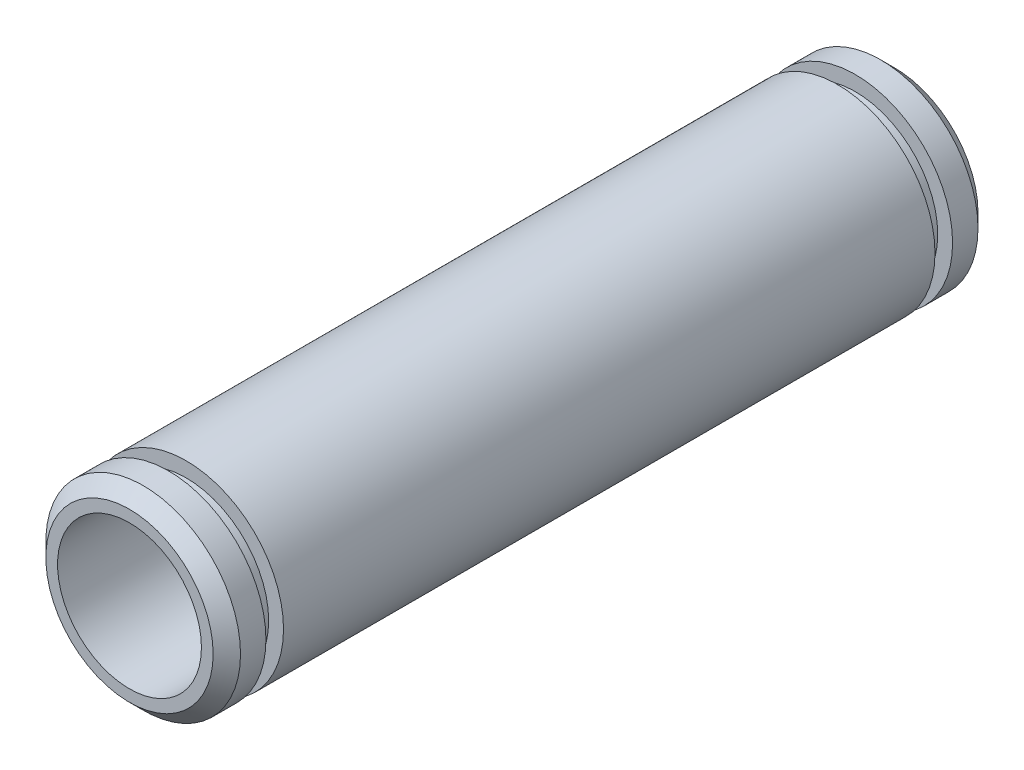
ISO-10303-21;
HEADER;
FILE_DESCRIPTION(('STEP AP214'),'2;1');
FILE_NAME('part.step','',(''),(''),'','','');
FILE_SCHEMA(('AUTOMOTIVE_DESIGN { 1 0 10303 214 1 1 1 1 }'));
ENDSEC;
DATA;
#1=APPLICATION_CONTEXT('core data for automotive mechanical design processes');
#2=APPLICATION_PROTOCOL_DEFINITION('international standard','automotive_design',2000,#1);
#3=PRODUCT_CONTEXT('',#1,'mechanical');
#4=PRODUCT('Part','Part','',(#3));
#5=PRODUCT_RELATED_PRODUCT_CATEGORY('part','',(#4));
#6=PRODUCT_DEFINITION_FORMATION('','',#4);
#7=PRODUCT_DEFINITION_CONTEXT('part definition',#1,'design');
#8=PRODUCT_DEFINITION('design','',#6,#7);
#9=PRODUCT_DEFINITION_SHAPE('','',#8);
#10=(LENGTH_UNIT() NAMED_UNIT(*) SI_UNIT(.MILLI.,.METRE.));
#11=(NAMED_UNIT(*) PLANE_ANGLE_UNIT() SI_UNIT($,.RADIAN.));
#12=(NAMED_UNIT(*) SI_UNIT($,.STERADIAN.) SOLID_ANGLE_UNIT());
#13=UNCERTAINTY_MEASURE_WITH_UNIT(LENGTH_MEASURE(1.E-05),#10,'distance_accuracy_value','');
#14=(GEOMETRIC_REPRESENTATION_CONTEXT(3) GLOBAL_UNCERTAINTY_ASSIGNED_CONTEXT((#13)) GLOBAL_UNIT_ASSIGNED_CONTEXT((#10,
#11,#12)) REPRESENTATION_CONTEXT('',''));
#15=CARTESIAN_POINT('',(0.,0.,0.));
#16=DIRECTION('',(0.,0.,1.));
#17=DIRECTION('',(1.,0.,0.));
#18=AXIS2_PLACEMENT_3D('',#15,#16,#17);
#19=CARTESIAN_POINT('',(0.,0.,24.84755));
#20=DIRECTION('',(0.,0.,-1.));
#21=DIRECTION('',(-1.,0.,0.));
#22=AXIS2_PLACEMENT_3D('',#19,#20,#21);
#23=CYLINDRICAL_SURFACE('',#22,6.3246);
#24=CARTESIAN_POINT('',(0.,0.,21.1645499999999));
#25=DIRECTION('',(0.,0.,1.));
#26=DIRECTION('',(1.,0.,0.));
#27=AXIS2_PLACEMENT_3D('',#24,#25,#26);
#28=CIRCLE('',#27,6.32460000000007);
#29=CARTESIAN_POINT('',(6.3246,0.,21.16455));
#30=VERTEX_POINT('',#29);
#31=EDGE_CURVE('E71',#30,#30,#28,.T.);
#32=ORIENTED_EDGE('',*,*,#31,.F.);
#33=EDGE_LOOP('',(#32));
#34=FACE_BOUND('',#33,.T.);
#35=CARTESIAN_POINT('',(0.,0.,-21.1645499999999));
#36=DIRECTION('',(0.,0.,1.));
#37=DIRECTION('',(1.,0.,0.));
#38=AXIS2_PLACEMENT_3D('',#35,#36,#37);
#39=CIRCLE('',#38,6.32460000000007);
#40=CARTESIAN_POINT('',(6.3246,0.,-21.16455));
#41=VERTEX_POINT('',#40);
#42=EDGE_CURVE('E57',#41,#41,#39,.T.);
#43=ORIENTED_EDGE('',*,*,#42,.T.);
#44=EDGE_LOOP('',(#43));
#45=FACE_BOUND('',#44,.T.);
#46=ADVANCED_FACE('F32',(#34,#45),#23,.T.);
#47=CARTESIAN_POINT('',(0.,0.,23.95855));
#48=DIRECTION('',(0.,0.,1.));
#49=DIRECTION('',(1.,0.,0.));
#50=AXIS2_PLACEMENT_3D('',#47,#48,#49);
#51=CIRCLE('',#50,6.3246);
#52=CARTESIAN_POINT('',(6.3246,0.,23.95855));
#53=VERTEX_POINT('',#52);
#54=EDGE_CURVE('E44',#53,#53,#51,.F.);
#55=ORIENTED_EDGE('',*,*,#54,.T.);
#56=EDGE_LOOP('',(#55));
#57=FACE_BOUND('',#56,.T.);
#58=CARTESIAN_POINT('',(0.,0.,22.3075500000001));
#59=DIRECTION('',(0.,0.,1.));
#60=DIRECTION('',(1.,0.,0.));
#61=AXIS2_PLACEMENT_3D('',#58,#59,#60);
#62=CIRCLE('',#61,6.32460000000007);
#63=CARTESIAN_POINT('',(6.3246,0.,22.3075500000001));
#64=VERTEX_POINT('',#63);
#65=EDGE_CURVE('E80',#64,#64,#62,.T.);
#66=ORIENTED_EDGE('',*,*,#65,.T.);
#67=EDGE_LOOP('',(#66));
#68=FACE_BOUND('',#67,.T.);
#69=ADVANCED_FACE('F84',(#57,#68),#23,.T.);
#70=CARTESIAN_POINT('',(0.,0.,24.84755));
#71=DIRECTION('',(0.,0.,1.));
#72=DIRECTION('',(1.,0.,0.));
#73=AXIS2_PLACEMENT_3D('',#70,#71,#72);
#74=PLANE('',#73);
#75=CARTESIAN_POINT('',(0.,0.,24.84755));
#76=DIRECTION('',(0.,0.,1.));
#77=DIRECTION('',(1.,0.,0.));
#78=AXIS2_PLACEMENT_3D('',#75,#76,#77);
#79=CIRCLE('',#78,5.4356);
#80=CARTESIAN_POINT('',(5.4356,0.,24.84755));
#81=VERTEX_POINT('',#80);
#82=EDGE_CURVE('E48',#81,#81,#79,.T.);
#83=ORIENTED_EDGE('',*,*,#82,.T.);
#84=EDGE_LOOP('',(#83));
#85=FACE_BOUND('',#84,.T.);
#86=CARTESIAN_POINT('',(0.,0.,24.84755));
#87=DIRECTION('',(0.,0.,1.));
#88=DIRECTION('',(1.,0.,0.));
#89=AXIS2_PLACEMENT_3D('',#86,#87,#88);
#90=CIRCLE('',#89,4.6736);
#91=CARTESIAN_POINT('',(4.6736,0.,24.84755));
#92=VERTEX_POINT('',#91);
#93=EDGE_CURVE('E53',#92,#92,#90,.T.);
#94=ORIENTED_EDGE('',*,*,#93,.F.);
#95=EDGE_LOOP('',(#94));
#96=FACE_BOUND('',#95,.T.);
#97=ADVANCED_FACE('F107',(#85,#96),#74,.T.);
#98=CARTESIAN_POINT('',(0.,0.,-24.84755));
#99=DIRECTION('',(0.,0.,1.));
#100=DIRECTION('',(1.,0.,0.));
#101=AXIS2_PLACEMENT_3D('',#98,#99,#100);
#102=PLANE('',#101);
#103=CARTESIAN_POINT('',(0.,0.,-24.84755));
#104=DIRECTION('',(0.,0.,1.));
#105=DIRECTION('',(1.,0.,0.));
#106=AXIS2_PLACEMENT_3D('',#103,#104,#105);
#107=CIRCLE('',#106,5.43559999999999);
#108=CARTESIAN_POINT('',(5.43559999999999,0.,-24.84755));
#109=VERTEX_POINT('',#108);
#110=EDGE_CURVE('E10',#109,#109,#107,.F.);
#111=ORIENTED_EDGE('',*,*,#110,.T.);
#112=EDGE_LOOP('',(#111));
#113=FACE_BOUND('',#112,.T.);
#114=CARTESIAN_POINT('',(0.,0.,-24.84755));
#115=DIRECTION('',(0.,0.,1.));
#116=DIRECTION('',(1.,0.,0.));
#117=AXIS2_PLACEMENT_3D('',#114,#115,#116);
#118=CIRCLE('',#117,4.6736);
#119=CARTESIAN_POINT('',(4.6736,0.,-24.84755));
#120=VERTEX_POINT('',#119);
#121=EDGE_CURVE('E54',#120,#120,#118,.T.);
#122=ORIENTED_EDGE('',*,*,#121,.T.);
#123=EDGE_LOOP('',(#122));
#124=FACE_BOUND('',#123,.T.);
#125=ADVANCED_FACE('F114',(#113,#124),#102,.F.);
#126=CARTESIAN_POINT('',(0.,0.,-23.95855));
#127=DIRECTION('',(0.,0.,1.));
#128=DIRECTION('',(1.,0.,0.));
#129=AXIS2_PLACEMENT_3D('',#126,#127,#128);
#130=CIRCLE('',#129,6.3246);
#131=CARTESIAN_POINT('',(6.3246,0.,-23.95855));
#132=VERTEX_POINT('',#131);
#133=EDGE_CURVE('E40',#132,#132,#130,.T.);
#134=ORIENTED_EDGE('',*,*,#133,.T.);
#135=EDGE_LOOP('',(#134));
#136=FACE_BOUND('',#135,.T.);
#137=CARTESIAN_POINT('',(0.,0.,-22.3075500000001));
#138=DIRECTION('',(0.,0.,1.));
#139=DIRECTION('',(1.,0.,0.));
#140=AXIS2_PLACEMENT_3D('',#137,#138,#139);
#141=CIRCLE('',#140,6.32460000000007);
#142=CARTESIAN_POINT('',(6.3246,0.,-22.3075500000001));
#143=VERTEX_POINT('',#142);
#144=EDGE_CURVE('E68',#143,#143,#141,.T.);
#145=ORIENTED_EDGE('',*,*,#144,.F.);
#146=EDGE_LOOP('',(#145));
#147=FACE_BOUND('',#146,.T.);
#148=ADVANCED_FACE('F103',(#136,#147),#23,.T.);
#149=CARTESIAN_POINT('',(0.,0.,24.84755));
#150=DIRECTION('',(0.,0.,-1.));
#151=DIRECTION('',(-1.,0.,0.));
#152=AXIS2_PLACEMENT_3D('',#149,#150,#151);
#153=CYLINDRICAL_SURFACE('',#152,4.6736);
#154=ORIENTED_EDGE('',*,*,#93,.T.);
#155=EDGE_LOOP('',(#154));
#156=FACE_BOUND('',#155,.T.);
#157=ORIENTED_EDGE('',*,*,#121,.F.);
#158=EDGE_LOOP('',(#157));
#159=FACE_BOUND('',#158,.T.);
#160=ADVANCED_FACE('F113',(#156,#159),#153,.F.);
#161=CARTESIAN_POINT('',(6.3246,0.,-21.16455));
#162=DIRECTION('',(0.,0.,1.));
#163=DIRECTION('',(1.,0.,0.));
#164=AXIS2_PLACEMENT_3D('',#161,#162,#163);
#165=PLANE('',#164);
#166=ORIENTED_EDGE('',*,*,#42,.F.);
#167=EDGE_LOOP('',(#166));
#168=FACE_BOUND('',#167,.T.);
#169=CARTESIAN_POINT('',(0.,0.,-21.1645499999999));
#170=DIRECTION('',(0.,0.,1.));
#171=DIRECTION('',(1.,0.,0.));
#172=AXIS2_PLACEMENT_3D('',#169,#170,#171);
#173=CIRCLE('',#172,5.35940000000007);
#174=CARTESIAN_POINT('',(5.3594,0.,-21.16455));
#175=VERTEX_POINT('',#174);
#176=EDGE_CURVE('E62',#175,#175,#173,.T.);
#177=ORIENTED_EDGE('',*,*,#176,.T.);
#178=EDGE_LOOP('',(#177));
#179=FACE_BOUND('',#178,.T.);
#180=ADVANCED_FACE('F119',(#168,#179),#165,.F.);
#181=CARTESIAN_POINT('',(3.43024899888577E-12,0.,1000.));
#182=DIRECTION('',(0.,0.,1.));
#183=DIRECTION('',(1.,0.,0.));
#184=AXIS2_PLACEMENT_3D('',#181,#182,#183);
#185=CYLINDRICAL_SURFACE('',#184,5.35940000000007);
#186=ORIENTED_EDGE('',*,*,#176,.F.);
#187=EDGE_LOOP('',(#186));
#188=FACE_BOUND('',#187,.T.);
#189=CARTESIAN_POINT('',(0.,0.,-22.3075500000001));
#190=DIRECTION('',(0.,0.,1.));
#191=DIRECTION('',(1.,0.,0.));
#192=AXIS2_PLACEMENT_3D('',#189,#190,#191);
#193=CIRCLE('',#192,5.35940000000007);
#194=CARTESIAN_POINT('',(5.3594,0.,-22.3075500000001));
#195=VERTEX_POINT('',#194);
#196=EDGE_CURVE('E65',#195,#195,#193,.T.);
#197=ORIENTED_EDGE('',*,*,#196,.T.);
#198=EDGE_LOOP('',(#197));
#199=FACE_BOUND('',#198,.T.);
#200=ADVANCED_FACE('F127',(#188,#199),#185,.T.);
#201=CARTESIAN_POINT('',(6.3246,0.,-22.30755));
#202=DIRECTION('',(0.,0.,-1.));
#203=DIRECTION('',(-1.,0.,0.));
#204=AXIS2_PLACEMENT_3D('',#201,#202,#203);
#205=PLANE('',#204);
#206=ORIENTED_EDGE('',*,*,#196,.F.);
#207=EDGE_LOOP('',(#206));
#208=FACE_BOUND('',#207,.T.);
#209=ORIENTED_EDGE('',*,*,#144,.T.);
#210=EDGE_LOOP('',(#209));
#211=FACE_BOUND('',#210,.T.);
#212=ADVANCED_FACE('F125',(#208,#211),#205,.F.);
#213=CARTESIAN_POINT('',(6.3246,0.,21.16455));
#214=DIRECTION('',(0.,0.,-1.));
#215=DIRECTION('',(1.,0.,0.));
#216=AXIS2_PLACEMENT_3D('',#213,#214,#215);
#217=PLANE('',#216);
#218=ORIENTED_EDGE('',*,*,#31,.T.);
#219=EDGE_LOOP('',(#218));
#220=FACE_BOUND('',#219,.T.);
#221=CARTESIAN_POINT('',(0.,0.,21.1645499999999));
#222=DIRECTION('',(0.,0.,1.));
#223=DIRECTION('',(1.,0.,0.));
#224=AXIS2_PLACEMENT_3D('',#221,#222,#223);
#225=CIRCLE('',#224,5.35940000000007);
#226=CARTESIAN_POINT('',(5.3594,0.,21.16455));
#227=VERTEX_POINT('',#226);
#228=EDGE_CURVE('E74',#227,#227,#225,.T.);
#229=ORIENTED_EDGE('',*,*,#228,.F.);
#230=EDGE_LOOP('',(#229));
#231=FACE_BOUND('',#230,.T.);
#232=ADVANCED_FACE('F97',(#220,#231),#217,.F.);
#233=CARTESIAN_POINT('',(3.43024899888577E-12,0.,-1000.));
#234=DIRECTION('',(0.,0.,-1.));
#235=DIRECTION('',(1.,0.,0.));
#236=AXIS2_PLACEMENT_3D('',#233,#234,#235);
#237=CYLINDRICAL_SURFACE('',#236,5.35940000000007);
#238=ORIENTED_EDGE('',*,*,#228,.T.);
#239=EDGE_LOOP('',(#238));
#240=FACE_BOUND('',#239,.T.);
#241=CARTESIAN_POINT('',(0.,0.,22.3075500000001));
#242=DIRECTION('',(0.,0.,1.));
#243=DIRECTION('',(1.,0.,0.));
#244=AXIS2_PLACEMENT_3D('',#241,#242,#243);
#245=CIRCLE('',#244,5.35940000000007);
#246=CARTESIAN_POINT('',(5.3594,0.,22.3075500000001));
#247=VERTEX_POINT('',#246);
#248=EDGE_CURVE('E77',#247,#247,#245,.T.);
#249=ORIENTED_EDGE('',*,*,#248,.F.);
#250=EDGE_LOOP('',(#249));
#251=FACE_BOUND('',#250,.T.);
#252=ADVANCED_FACE('F89',(#240,#251),#237,.T.);
#253=CARTESIAN_POINT('',(6.3246,0.,22.30755));
#254=DIRECTION('',(0.,0.,1.));
#255=DIRECTION('',(-1.,0.,0.));
#256=AXIS2_PLACEMENT_3D('',#253,#254,#255);
#257=PLANE('',#256);
#258=ORIENTED_EDGE('',*,*,#248,.T.);
#259=EDGE_LOOP('',(#258));
#260=FACE_BOUND('',#259,.T.);
#261=ORIENTED_EDGE('',*,*,#65,.F.);
#262=EDGE_LOOP('',(#261));
#263=FACE_BOUND('',#262,.T.);
#264=ADVANCED_FACE('F86',(#260,#263),#257,.F.);
#265=CARTESIAN_POINT('',(0.,0.,24.84755));
#266=DIRECTION('',(0.,0.,-1.));
#267=DIRECTION('',(-1.,0.,0.));
#268=AXIS2_PLACEMENT_3D('',#265,#266,#267);
#269=CONICAL_SURFACE('',#268,5.4356,0.785398163397448);
#270=ORIENTED_EDGE('',*,*,#54,.F.);
#271=EDGE_LOOP('',(#270));
#272=FACE_BOUND('',#271,.T.);
#273=ORIENTED_EDGE('',*,*,#82,.F.);
#274=EDGE_LOOP('',(#273));
#275=FACE_BOUND('',#274,.T.);
#276=ADVANCED_FACE('F88',(#272,#275),#269,.T.);
#277=CARTESIAN_POINT('',(0.,0.,-23.95855));
#278=DIRECTION('',(0.,0.,1.));
#279=DIRECTION('',(1.,0.,0.));
#280=AXIS2_PLACEMENT_3D('',#277,#278,#279);
#281=CONICAL_SURFACE('',#280,6.3246,0.785398163397447);
#282=ORIENTED_EDGE('',*,*,#110,.F.);
#283=EDGE_LOOP('',(#282));
#284=FACE_BOUND('',#283,.T.);
#285=ORIENTED_EDGE('',*,*,#133,.F.);
#286=EDGE_LOOP('',(#285));
#287=FACE_BOUND('',#286,.T.);
#288=ADVANCED_FACE('F35',(#284,#287),#281,.T.);
#289=CLOSED_SHELL('',(#46,#69,#97,#125,#148,#160,#180,#200,#212,#232,#252,#264,#276,#288));
#290=MANIFOLD_SOLID_BREP('B2',#289);
#291=ADVANCED_BREP_SHAPE_REPRESENTATION('',(#18,#290),#14);
#292=SHAPE_DEFINITION_REPRESENTATION(#9,#291);
ENDSEC;
END-ISO-10303-21;
